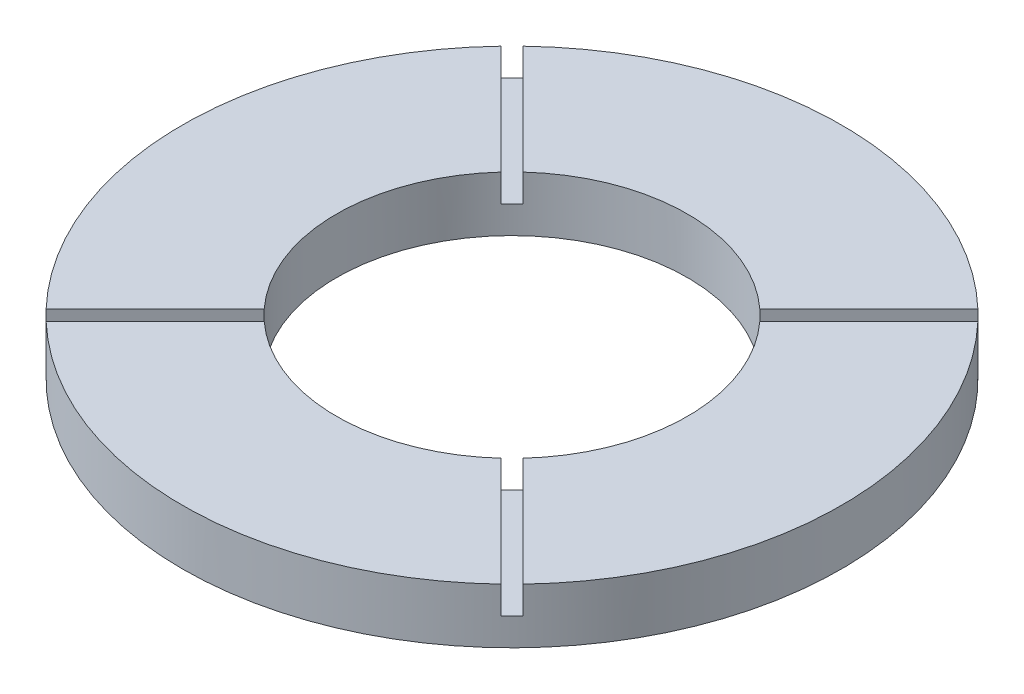
ISO-10303-21;
HEADER;
FILE_DESCRIPTION(('STEP AP214'),'2;1');
FILE_NAME('part.step','',(''),(''),'','','');
FILE_SCHEMA(('AUTOMOTIVE_DESIGN { 1 0 10303 214 1 1 1 1 }'));
ENDSEC;
DATA;
#1=APPLICATION_CONTEXT('core data for automotive mechanical design processes');
#2=APPLICATION_PROTOCOL_DEFINITION('international standard','automotive_design',2000,#1);
#3=PRODUCT_CONTEXT('',#1,'mechanical');
#4=PRODUCT('Part','Part','',(#3));
#5=PRODUCT_RELATED_PRODUCT_CATEGORY('part','',(#4));
#6=PRODUCT_DEFINITION_FORMATION('','',#4);
#7=PRODUCT_DEFINITION_CONTEXT('part definition',#1,'design');
#8=PRODUCT_DEFINITION('design','',#6,#7);
#9=PRODUCT_DEFINITION_SHAPE('','',#8);
#10=(LENGTH_UNIT() NAMED_UNIT(*) SI_UNIT(.MILLI.,.METRE.));
#11=(NAMED_UNIT(*) PLANE_ANGLE_UNIT() SI_UNIT($,.RADIAN.));
#12=(NAMED_UNIT(*) SI_UNIT($,.STERADIAN.) SOLID_ANGLE_UNIT());
#13=UNCERTAINTY_MEASURE_WITH_UNIT(LENGTH_MEASURE(1.E-05),#10,'distance_accuracy_value','');
#14=(GEOMETRIC_REPRESENTATION_CONTEXT(3) GLOBAL_UNCERTAINTY_ASSIGNED_CONTEXT((#13)) GLOBAL_UNIT_ASSIGNED_CONTEXT((#10,
#11,#12)) REPRESENTATION_CONTEXT('',''));
#15=CARTESIAN_POINT('',(0.,0.,0.));
#16=DIRECTION('',(0.,0.,1.));
#17=DIRECTION('',(1.,0.,0.));
#18=AXIS2_PLACEMENT_3D('',#15,#16,#17);
#19=CARTESIAN_POINT('',(0.,12.7000000000001,9.99200722162641E-13));
#20=DIRECTION('',(0.,1.,0.));
#21=DIRECTION('',(0.,0.,0.999999999999999));
#22=AXIS2_PLACEMENT_3D('',#19,#20,#21);
#23=PLANE('',#22);
#24=DIRECTION('',(0.707106781186543,0.,-0.707106781186551));
#25=VECTOR('',#24,1.);
#26=CARTESIAN_POINT('',(-25.7014930184937,12.7,28.1800437079164));
#27=LINE('',#26,#25);
#28=CARTESIAN_POINT('',(-52.4303897259785,12.7000000000001,54.9089404154025));
#29=VERTEX_POINT('',#28);
#30=CARTESIAN_POINT('',(-27.3090139490452,12.7000000000001,29.787564638468));
#31=VERTEX_POINT('',#30);
#32=EDGE_CURVE('E258',#29,#31,#27,.T.);
#33=ORIENTED_EDGE('',*,*,#32,.F.);
#34=CARTESIAN_POINT('',(0.,12.7000000000001,9.99200722162641E-13));
#35=DIRECTION('',(0.,1.,0.));
#36=DIRECTION('',(0.,0.,0.999999999999999));
#37=AXIS2_PLACEMENT_3D('',#34,#35,#36);
#38=CIRCLE('',#37,75.9206);
#39=CARTESIAN_POINT('',(52.4303897259886,12.7,54.908940415391));
#40=VERTEX_POINT('',#39);
#41=EDGE_CURVE('E199',#29,#40,#38,.T.);
#42=ORIENTED_EDGE('',*,*,#41,.T.);
#43=DIRECTION('',(0.707106781186551,0.,0.707106781186543));
#44=VECTOR('',#43,1.);
#45=CARTESIAN_POINT('',(25.7014930185064,12.7000000000001,28.1800437079101));
#46=LINE('',#45,#44);
#47=CARTESIAN_POINT('',(27.3090139490553,12.7000000000001,29.7875646384589));
#48=VERTEX_POINT('',#47);
#49=EDGE_CURVE('E328',#48,#40,#46,.T.);
#50=ORIENTED_EDGE('',*,*,#49,.F.);
#51=CARTESIAN_POINT('',(0.,12.7000000000001,9.99200722162641E-13));
#52=DIRECTION('',(0.,1.,0.));
#53=DIRECTION('',(0.,0.,0.999999999999999));
#54=AXIS2_PLACEMENT_3D('',#51,#52,#53);
#55=CIRCLE('',#54,40.4114);
#56=EDGE_CURVE('E266',#31,#48,#55,.T.);
#57=ORIENTED_EDGE('',*,*,#56,.F.);
#58=EDGE_LOOP('',(#33,#42,#50,#57));
#59=FACE_BOUND('',#58,.T.);
#60=ADVANCED_FACE('F53',(#59),#23,.T.);
#61=DIRECTION('',(-0.707106781186551,0.,-0.707106781186543));
#62=VECTOR('',#61,1.);
#63=CARTESIAN_POINT('',(28.1800437079215,12.7000000000001,25.7014930184949));
#64=LINE('',#63,#62);
#65=CARTESIAN_POINT('',(54.9089404154024,12.7,52.4303897259765));
#66=VERTEX_POINT('',#65);
#67=CARTESIAN_POINT('',(29.7875646384689,12.7000000000001,27.3090139490442));
#68=VERTEX_POINT('',#67);
#69=EDGE_CURVE('E332',#66,#68,#64,.T.);
#70=ORIENTED_EDGE('',*,*,#69,.F.);
#71=CARTESIAN_POINT('',(54.908940415394,12.7000000000001,-52.4303897259843));
#72=VERTEX_POINT('',#71);
#73=EDGE_CURVE('E205',#66,#72,#38,.T.);
#74=ORIENTED_EDGE('',*,*,#73,.T.);
#75=DIRECTION('',(0.707106781186543,0.,-0.707106781186551));
#76=VECTOR('',#75,1.);
#77=CARTESIAN_POINT('',(28.1800437079152,12.7000000000002,-25.7014930185051));
#78=LINE('',#77,#76);
#79=CARTESIAN_POINT('',(29.7875646384609,12.7000000000001,-27.3090139490509));
#80=VERTEX_POINT('',#79);
#81=EDGE_CURVE('E341',#80,#72,#78,.T.);
#82=ORIENTED_EDGE('',*,*,#81,.F.);
#83=EDGE_CURVE('E215',#68,#80,#55,.T.);
#84=ORIENTED_EDGE('',*,*,#83,.F.);
#85=EDGE_LOOP('',(#70,#74,#82,#84));
#86=FACE_BOUND('',#85,.T.);
#87=ADVANCED_FACE('F360',(#86),#23,.T.);
#88=DIRECTION('',(-0.707106781186543,0.,0.707106781186551));
#89=VECTOR('',#88,1.);
#90=CARTESIAN_POINT('',(25.7014930185,12.7000000000002,-28.1800437079203));
#91=LINE('',#90,#89);
#92=CARTESIAN_POINT('',(52.4303897259788,12.7000000000001,-54.9089404153993));
#93=VERTEX_POINT('',#92);
#94=CARTESIAN_POINT('',(27.3090139490465,12.7000000000001,-29.7875646384658));
#95=VERTEX_POINT('',#94);
#96=EDGE_CURVE('E190',#93,#95,#91,.T.);
#97=ORIENTED_EDGE('',*,*,#96,.F.);
#98=CARTESIAN_POINT('',(-52.4303897259822,12.7000000000002,-54.9089404153948));
#99=VERTEX_POINT('',#98);
#100=EDGE_CURVE('E198',#93,#99,#38,.T.);
#101=ORIENTED_EDGE('',*,*,#100,.T.);
#102=DIRECTION('',(-0.707106781186551,0.,-0.707106781186543));
#103=VECTOR('',#102,1.);
#104=CARTESIAN_POINT('',(-25.7014930185001,12.7000000000001,-28.1800437079138));
#105=LINE('',#104,#103);
#106=CARTESIAN_POINT('',(-27.3090139490488,12.7000000000001,-29.7875646384627));
#107=VERTEX_POINT('',#106);
#108=EDGE_CURVE('E189',#107,#99,#105,.T.);
#109=ORIENTED_EDGE('',*,*,#108,.F.);
#110=EDGE_CURVE('E265',#95,#107,#55,.T.);
#111=ORIENTED_EDGE('',*,*,#110,.F.);
#112=EDGE_LOOP('',(#97,#101,#109,#111));
#113=FACE_BOUND('',#112,.T.);
#114=ADVANCED_FACE('F402',(#113),#23,.T.);
#115=CARTESIAN_POINT('',(0.,12.7000000000001,9.99200722162641E-13));
#116=DIRECTION('',(0.,-1.,0.));
#117=DIRECTION('',(0.,0.,-0.999999999999999));
#118=AXIS2_PLACEMENT_3D('',#115,#116,#117);
#119=CYLINDRICAL_SURFACE('',#118,75.9206);
#120=ORIENTED_EDGE('',*,*,#41,.F.);
#121=DIRECTION('',(0.,-1.,0.));
#122=VECTOR('',#121,1.);
#123=CARTESIAN_POINT('',(-52.4303897259785,12.7000000000001,54.9089404154025));
#124=LINE('',#123,#122);
#125=CARTESIAN_POINT('',(-52.4303897259785,6.35000000000012,54.9089404154025));
#126=VERTEX_POINT('',#125);
#127=EDGE_CURVE('E273',#29,#126,#124,.T.);
#128=ORIENTED_EDGE('',*,*,#127,.T.);
#129=CARTESIAN_POINT('',(0.,6.35000000000012,9.99200722162641E-13));
#130=DIRECTION('',(0.,-1.,0.));
#131=DIRECTION('',(0.,0.,-0.999999999999999));
#132=AXIS2_PLACEMENT_3D('',#129,#130,#131);
#133=CIRCLE('',#132,75.9206);
#134=CARTESIAN_POINT('',(-54.9089404153937,6.35000000000012,52.4303897259876));
#135=VERTEX_POINT('',#134);
#136=EDGE_CURVE('E279',#126,#135,#133,.T.);
#137=ORIENTED_EDGE('',*,*,#136,.T.);
#138=DIRECTION('',(0.,-1.,0.));
#139=VECTOR('',#138,1.);
#140=CARTESIAN_POINT('',(-54.9089404153937,12.7000000000001,52.4303897259876));
#141=LINE('',#140,#139);
#142=CARTESIAN_POINT('',(-54.9089404153937,12.7000000000001,52.4303897259876));
#143=VERTEX_POINT('',#142);
#144=EDGE_CURVE('E196',#135,#143,#141,.F.);
#145=ORIENTED_EDGE('',*,*,#144,.T.);
#146=CARTESIAN_POINT('',(-54.9089404153974,12.7000000000003,-52.4303897259808));
#147=VERTEX_POINT('',#146);
#148=EDGE_CURVE('E185',#147,#143,#38,.T.);
#149=ORIENTED_EDGE('',*,*,#148,.F.);
#150=DIRECTION('',(0.,-1.,0.));
#151=VECTOR('',#150,1.);
#152=CARTESIAN_POINT('',(-54.9089404153974,12.7000000000003,-52.4303897259808));
#153=LINE('',#152,#151);
#154=CARTESIAN_POINT('',(-54.9089404153974,6.35000000000024,-52.4303897259808));
#155=VERTEX_POINT('',#154);
#156=EDGE_CURVE('E166',#147,#155,#153,.T.);
#157=ORIENTED_EDGE('',*,*,#156,.T.);
#158=CARTESIAN_POINT('',(0.,6.35000000000012,9.99200722162641E-13));
#159=DIRECTION('',(0.,-1.,0.));
#160=DIRECTION('',(0.,0.,-0.999999999999999));
#161=AXIS2_PLACEMENT_3D('',#158,#159,#160);
#162=CIRCLE('',#161,75.9206);
#163=CARTESIAN_POINT('',(-52.4303897259824,6.35000000000024,-54.9089404153948));
#164=VERTEX_POINT('',#163);
#165=EDGE_CURVE('E308',#155,#164,#162,.T.);
#166=ORIENTED_EDGE('',*,*,#165,.T.);
#167=DIRECTION('',(0.,-1.,0.));
#168=VECTOR('',#167,1.);
#169=CARTESIAN_POINT('',(-52.4303897259822,12.7000000000002,-54.9089404153948));
#170=LINE('',#169,#168);
#171=EDGE_CURVE('E178',#164,#99,#170,.F.);
#172=ORIENTED_EDGE('',*,*,#171,.T.);
#173=ORIENTED_EDGE('',*,*,#100,.F.);
#174=DIRECTION('',(0.,-1.,0.));
#175=VECTOR('',#174,1.);
#176=CARTESIAN_POINT('',(52.4303897259788,12.7000000000001,-54.9089404153993));
#177=LINE('',#176,#175);
#178=CARTESIAN_POINT('',(52.4303897259788,6.35000000000012,-54.9089404153993));
#179=VERTEX_POINT('',#178);
#180=EDGE_CURVE('E294',#93,#179,#177,.T.);
#181=ORIENTED_EDGE('',*,*,#180,.T.);
#182=CARTESIAN_POINT('',(0.,6.35000000000012,9.99200722162641E-13));
#183=DIRECTION('',(0.,-1.,0.));
#184=DIRECTION('',(0.,0.,-0.999999999999999));
#185=AXIS2_PLACEMENT_3D('',#182,#183,#184);
#186=CIRCLE('',#185,75.9206);
#187=CARTESIAN_POINT('',(54.9089404153931,6.35000000000012,-52.4303897259843));
#188=VERTEX_POINT('',#187);
#189=EDGE_CURVE('E177',#179,#188,#186,.T.);
#190=ORIENTED_EDGE('',*,*,#189,.T.);
#191=DIRECTION('',(0.,-1.,0.));
#192=VECTOR('',#191,1.);
#193=CARTESIAN_POINT('',(54.908940415394,12.7000000000001,-52.4303897259843));
#194=LINE('',#193,#192);
#195=EDGE_CURVE('E298',#188,#72,#194,.F.);
#196=ORIENTED_EDGE('',*,*,#195,.T.);
#197=ORIENTED_EDGE('',*,*,#73,.F.);
#198=DIRECTION('',(0.,-1.,0.));
#199=VECTOR('',#198,1.);
#200=CARTESIAN_POINT('',(54.9089404154024,12.7,52.4303897259765));
#201=LINE('',#200,#199);
#202=CARTESIAN_POINT('',(54.9089404154024,6.35000000000001,52.4303897259765));
#203=VERTEX_POINT('',#202);
#204=EDGE_CURVE('E282',#66,#203,#201,.T.);
#205=ORIENTED_EDGE('',*,*,#204,.T.);
#206=CARTESIAN_POINT('',(0.,6.35000000000012,9.99200722162641E-13));
#207=DIRECTION('',(0.,-1.,0.));
#208=DIRECTION('',(0.,0.,-0.999999999999999));
#209=AXIS2_PLACEMENT_3D('',#206,#207,#208);
#210=CIRCLE('',#209,75.9206);
#211=CARTESIAN_POINT('',(52.4303897259886,6.35000000000001,54.908940415391));
#212=VERTEX_POINT('',#211);
#213=EDGE_CURVE('E290',#203,#212,#210,.T.);
#214=ORIENTED_EDGE('',*,*,#213,.T.);
#215=DIRECTION('',(0.,-1.,0.));
#216=VECTOR('',#215,1.);
#217=CARTESIAN_POINT('',(52.4303897259886,12.7,54.908940415391));
#218=LINE('',#217,#216);
#219=EDGE_CURVE('E286',#212,#40,#218,.F.);
#220=ORIENTED_EDGE('',*,*,#219,.T.);
#221=EDGE_LOOP('',(#120,#128,#137,#145,#149,#157,#166,#172,#173,#181,#190,#196,#197,#205,#214,#220));
#222=FACE_BOUND('',#221,.T.);
#223=CARTESIAN_POINT('',(0.,0.,0.));
#224=DIRECTION('',(0.,1.,0.));
#225=DIRECTION('',(0.,0.,0.999999999999999));
#226=AXIS2_PLACEMENT_3D('',#223,#224,#225);
#227=CIRCLE('',#226,75.9206);
#228=CARTESIAN_POINT('',(0.,0.,75.9205999999999));
#229=VERTEX_POINT('',#228);
#230=EDGE_CURVE('E207',#229,#229,#227,.T.);
#231=ORIENTED_EDGE('',*,*,#230,.T.);
#232=EDGE_LOOP('',(#231));
#233=FACE_BOUND('',#232,.T.);
#234=ADVANCED_FACE('F55',(#222,#233),#119,.T.);
#235=DIRECTION('',(-0.707106781186543,0.,0.707106781186551));
#236=VECTOR('',#235,1.);
#237=CARTESIAN_POINT('',(-28.1800437079087,12.7,25.7014930185012));
#238=LINE('',#237,#236);
#239=CARTESIAN_POINT('',(-29.7875646384617,12.7000000000001,27.3090139490532));
#240=VERTEX_POINT('',#239);
#241=EDGE_CURVE('E252',#240,#143,#238,.T.);
#242=ORIENTED_EDGE('',*,*,#241,.F.);
#243=CARTESIAN_POINT('',(-29.787564638464,12.7000000000001,-27.3090139490475));
#244=VERTEX_POINT('',#243);
#245=EDGE_CURVE('E187',#244,#240,#55,.T.);
#246=ORIENTED_EDGE('',*,*,#245,.F.);
#247=DIRECTION('',(0.707106781186551,0.,0.707106781186544));
#248=VECTOR('',#247,1.);
#249=CARTESIAN_POINT('',(-28.1800437079152,12.7000000000001,-25.7014930184988));
#250=LINE('',#249,#248);
#251=EDGE_CURVE('E170',#147,#244,#250,.T.);
#252=ORIENTED_EDGE('',*,*,#251,.F.);
#253=ORIENTED_EDGE('',*,*,#148,.T.);
#254=EDGE_LOOP('',(#242,#246,#252,#253));
#255=FACE_BOUND('',#254,.T.);
#256=ADVANCED_FACE('F184',(#255),#23,.T.);
#257=CARTESIAN_POINT('',(0.,0.,0.));
#258=DIRECTION('',(0.,1.,0.));
#259=DIRECTION('',(0.,0.,0.999999999999999));
#260=AXIS2_PLACEMENT_3D('',#257,#258,#259);
#261=PLANE('',#260);
#262=CARTESIAN_POINT('',(0.,0.,0.));
#263=DIRECTION('',(0.,1.,0.));
#264=DIRECTION('',(0.,0.,0.999999999999999));
#265=AXIS2_PLACEMENT_3D('',#262,#263,#264);
#266=CIRCLE('',#265,40.4114);
#267=CARTESIAN_POINT('',(0.,0.,40.4114));
#268=VERTEX_POINT('',#267);
#269=EDGE_CURVE('E210',#268,#268,#266,.T.);
#270=ORIENTED_EDGE('',*,*,#269,.T.);
#271=EDGE_LOOP('',(#270));
#272=FACE_BOUND('',#271,.T.);
#273=ORIENTED_EDGE('',*,*,#230,.F.);
#274=EDGE_LOOP('',(#273));
#275=FACE_BOUND('',#274,.T.);
#276=ADVANCED_FACE('F405',(#272,#275),#261,.F.);
#277=CARTESIAN_POINT('',(0.,12.7000000000001,9.99200722162641E-13));
#278=DIRECTION('',(0.,-1.,0.));
#279=DIRECTION('',(0.,0.,-0.999999999999999));
#280=AXIS2_PLACEMENT_3D('',#277,#278,#279);
#281=CYLINDRICAL_SURFACE('',#280,40.4114);
#282=DIRECTION('',(0.,-1.,0.));
#283=VECTOR('',#282,1.);
#284=CARTESIAN_POINT('',(-27.3090139490453,12.7000000000001,29.787564638468));
#285=LINE('',#284,#283);
#286=CARTESIAN_POINT('',(-27.3090139490452,6.35000000000012,29.787564638468));
#287=VERTEX_POINT('',#286);
#288=EDGE_CURVE('E13',#31,#287,#285,.T.);
#289=ORIENTED_EDGE('',*,*,#288,.F.);
#290=ORIENTED_EDGE('',*,*,#56,.T.);
#291=DIRECTION('',(0.,-1.,0.));
#292=VECTOR('',#291,1.);
#293=CARTESIAN_POINT('',(27.3090139490553,12.7000000000001,29.7875646384589));
#294=LINE('',#293,#292);
#295=CARTESIAN_POINT('',(27.3090139490553,6.35000000000013,29.7875646384589));
#296=VERTEX_POINT('',#295);
#297=EDGE_CURVE('E238',#296,#48,#294,.F.);
#298=ORIENTED_EDGE('',*,*,#297,.F.);
#299=CARTESIAN_POINT('',(0.,6.35000000000012,9.99200722162641E-13));
#300=DIRECTION('',(0.,-1.,0.));
#301=DIRECTION('',(0.,0.,-0.999999999999999));
#302=AXIS2_PLACEMENT_3D('',#299,#300,#301);
#303=CIRCLE('',#302,40.4114);
#304=CARTESIAN_POINT('',(29.7875646384689,6.35000000000012,27.3090139490442));
#305=VERTEX_POINT('',#304);
#306=EDGE_CURVE('E235',#305,#296,#303,.T.);
#307=ORIENTED_EDGE('',*,*,#306,.F.);
#308=DIRECTION('',(0.,-1.,0.));
#309=VECTOR('',#308,1.);
#310=CARTESIAN_POINT('',(29.7875646384689,12.7000000000001,27.3090139490442));
#311=LINE('',#310,#309);
#312=EDGE_CURVE('E241',#68,#305,#311,.T.);
#313=ORIENTED_EDGE('',*,*,#312,.F.);
#314=ORIENTED_EDGE('',*,*,#83,.T.);
#315=DIRECTION('',(0.,-1.,0.));
#316=VECTOR('',#315,1.);
#317=CARTESIAN_POINT('',(29.7875646384609,12.7000000000001,-27.3090139490509));
#318=LINE('',#317,#316);
#319=CARTESIAN_POINT('',(29.7875646384609,6.35000000000013,-27.3090139490509));
#320=VERTEX_POINT('',#319);
#321=EDGE_CURVE('E228',#320,#80,#318,.F.);
#322=ORIENTED_EDGE('',*,*,#321,.F.);
#323=CARTESIAN_POINT('',(0.,6.35000000000012,9.99200722162641E-13));
#324=DIRECTION('',(0.,-1.,0.));
#325=DIRECTION('',(0.,0.,-0.999999999999999));
#326=AXIS2_PLACEMENT_3D('',#323,#324,#325);
#327=CIRCLE('',#326,40.4114);
#328=CARTESIAN_POINT('',(27.3090139490465,6.35000000000013,-29.7875646384658));
#329=VERTEX_POINT('',#328);
#330=EDGE_CURVE('E225',#329,#320,#327,.T.);
#331=ORIENTED_EDGE('',*,*,#330,.F.);
#332=DIRECTION('',(0.,-1.,0.));
#333=VECTOR('',#332,1.);
#334=CARTESIAN_POINT('',(27.3090139490465,12.7000000000001,-29.7875646384658));
#335=LINE('',#334,#333);
#336=EDGE_CURVE('E231',#95,#329,#335,.T.);
#337=ORIENTED_EDGE('',*,*,#336,.F.);
#338=ORIENTED_EDGE('',*,*,#110,.T.);
#339=DIRECTION('',(0.,-1.,0.));
#340=VECTOR('',#339,1.);
#341=CARTESIAN_POINT('',(-27.3090139490488,12.7000000000001,-29.7875646384627));
#342=LINE('',#341,#340);
#343=CARTESIAN_POINT('',(-27.3090139490489,6.35000000000012,-29.7875646384627));
#344=VERTEX_POINT('',#343);
#345=EDGE_CURVE('E219',#344,#107,#342,.F.);
#346=ORIENTED_EDGE('',*,*,#345,.F.);
#347=CARTESIAN_POINT('',(0.,6.35000000000012,9.99200722162641E-13));
#348=DIRECTION('',(0.,-1.,0.));
#349=DIRECTION('',(0.,0.,-0.999999999999999));
#350=AXIS2_PLACEMENT_3D('',#347,#348,#349);
#351=CIRCLE('',#350,40.4114);
#352=CARTESIAN_POINT('',(-29.787564638464,6.35000000000012,-27.3090139490475));
#353=VERTEX_POINT('',#352);
#354=EDGE_CURVE('E216',#353,#344,#351,.T.);
#355=ORIENTED_EDGE('',*,*,#354,.F.);
#356=DIRECTION('',(0.,-1.,0.));
#357=VECTOR('',#356,1.);
#358=CARTESIAN_POINT('',(-29.787564638464,12.7000000000001,-27.3090139490475));
#359=LINE('',#358,#357);
#360=EDGE_CURVE('E222',#244,#353,#359,.T.);
#361=ORIENTED_EDGE('',*,*,#360,.F.);
#362=ORIENTED_EDGE('',*,*,#245,.T.);
#363=DIRECTION('',(0.,-1.,0.));
#364=VECTOR('',#363,1.);
#365=CARTESIAN_POINT('',(-29.7875646384617,12.7000000000001,27.3090139490532));
#366=LINE('',#365,#364);
#367=CARTESIAN_POINT('',(-29.7875646384617,6.35000000000012,27.3090139490532));
#368=VERTEX_POINT('',#367);
#369=EDGE_CURVE('E62',#368,#240,#366,.F.);
#370=ORIENTED_EDGE('',*,*,#369,.F.);
#371=CARTESIAN_POINT('',(0.,6.35000000000012,9.99200722162641E-13));
#372=DIRECTION('',(0.,-1.,0.));
#373=DIRECTION('',(0.,0.,-0.999999999999999));
#374=AXIS2_PLACEMENT_3D('',#371,#372,#373);
#375=CIRCLE('',#374,40.4114);
#376=EDGE_CURVE('E244',#287,#368,#375,.T.);
#377=ORIENTED_EDGE('',*,*,#376,.F.);
#378=EDGE_LOOP('',(#289,#290,#298,#307,#313,#314,#322,#331,#337,#338,#346,#355,#361,#362,#370,#377));
#379=FACE_BOUND('',#378,.T.);
#380=ORIENTED_EDGE('',*,*,#269,.F.);
#381=EDGE_LOOP('',(#380));
#382=FACE_BOUND('',#381,.T.);
#383=ADVANCED_FACE('F261',(#379,#382),#281,.F.);
#384=CARTESIAN_POINT('',(-28.1800437079152,6.35000000000012,-25.7014930184988));
#385=DIRECTION('',(-0.707106781186544,0.,0.70710678118655));
#386=DIRECTION('',(0.70710678118655,0.,0.707106781186544));
#387=AXIS2_PLACEMENT_3D('',#384,#385,#386);
#388=PLANE('',#387);
#389=ORIENTED_EDGE('',*,*,#251,.T.);
#390=ORIENTED_EDGE('',*,*,#360,.T.);
#391=DIRECTION('',(0.707106781186551,0.,0.707106781186544));
#392=VECTOR('',#391,1.);
#393=CARTESIAN_POINT('',(-28.1800437079152,6.35000000000012,-25.7014930184988));
#394=LINE('',#393,#392);
#395=EDGE_CURVE('E172',#155,#353,#394,.T.);
#396=ORIENTED_EDGE('',*,*,#395,.F.);
#397=ORIENTED_EDGE('',*,*,#156,.F.);
#398=EDGE_LOOP('',(#389,#390,#396,#397));
#399=FACE_BOUND('',#398,.T.);
#400=ADVANCED_FACE('F168',(#399),#388,.F.);
#401=CARTESIAN_POINT('',(-25.7014930185001,6.35000000000012,-28.1800437079138));
#402=DIRECTION('',(0.707106781186543,0.,-0.70710678118655));
#403=DIRECTION('',(-0.707106781186551,0.,-0.707106781186544));
#404=AXIS2_PLACEMENT_3D('',#401,#402,#403);
#405=PLANE('',#404);
#406=DIRECTION('',(-0.707106781186551,0.,-0.707106781186543));
#407=VECTOR('',#406,1.);
#408=CARTESIAN_POINT('',(-25.7014930185001,6.35000000000012,-28.1800437079138));
#409=LINE('',#408,#407);
#410=EDGE_CURVE('E311',#344,#164,#409,.T.);
#411=ORIENTED_EDGE('',*,*,#410,.F.);
#412=ORIENTED_EDGE('',*,*,#345,.T.);
#413=ORIENTED_EDGE('',*,*,#108,.T.);
#414=ORIENTED_EDGE('',*,*,#171,.F.);
#415=EDGE_LOOP('',(#411,#412,#413,#414));
#416=FACE_BOUND('',#415,.T.);
#417=ADVANCED_FACE('F423',(#416),#405,.F.);
#418=CARTESIAN_POINT('',(0.,6.35000000000012,9.99200722162641E-13));
#419=DIRECTION('',(0.,-1.,0.));
#420=DIRECTION('',(0.,0.,-0.999999999999999));
#421=AXIS2_PLACEMENT_3D('',#418,#419,#420);
#422=PLANE('',#421);
#423=ORIENTED_EDGE('',*,*,#395,.T.);
#424=ORIENTED_EDGE('',*,*,#354,.T.);
#425=ORIENTED_EDGE('',*,*,#410,.T.);
#426=ORIENTED_EDGE('',*,*,#165,.F.);
#427=EDGE_LOOP('',(#423,#424,#425,#426));
#428=FACE_BOUND('',#427,.T.);
#429=ADVANCED_FACE('F426',(#428),#422,.F.);
#430=CARTESIAN_POINT('',(25.7014930185,6.35000000000024,-28.1800437079203));
#431=DIRECTION('',(-0.70710678118655,0.,-0.707106781186543));
#432=DIRECTION('',(-0.707106781186544,0.,0.707106781186551));
#433=AXIS2_PLACEMENT_3D('',#430,#431,#432);
#434=PLANE('',#433);
#435=ORIENTED_EDGE('',*,*,#96,.T.);
#436=ORIENTED_EDGE('',*,*,#336,.T.);
#437=DIRECTION('',(-0.707106781186543,0.,0.707106781186551));
#438=VECTOR('',#437,1.);
#439=CARTESIAN_POINT('',(25.7014930185,6.35000000000024,-28.1800437079203));
#440=LINE('',#439,#438);
#441=EDGE_CURVE('E338',#179,#329,#440,.T.);
#442=ORIENTED_EDGE('',*,*,#441,.F.);
#443=ORIENTED_EDGE('',*,*,#180,.F.);
#444=EDGE_LOOP('',(#435,#436,#442,#443));
#445=FACE_BOUND('',#444,.T.);
#446=ADVANCED_FACE('F429',(#445),#434,.F.);
#447=CARTESIAN_POINT('',(28.1800437079152,6.35000000000013,-25.7014930185051));
#448=DIRECTION('',(0.70710678118655,0.,0.707106781186543));
#449=DIRECTION('',(0.707106781186544,0.,-0.707106781186551));
#450=AXIS2_PLACEMENT_3D('',#447,#448,#449);
#451=PLANE('',#450);
#452=DIRECTION('',(0.707106781186543,0.,-0.707106781186551));
#453=VECTOR('',#452,1.);
#454=CARTESIAN_POINT('',(28.1800437079152,6.35000000000013,-25.7014930185051));
#455=LINE('',#454,#453);
#456=EDGE_CURVE('E335',#320,#188,#455,.T.);
#457=ORIENTED_EDGE('',*,*,#456,.F.);
#458=ORIENTED_EDGE('',*,*,#321,.T.);
#459=ORIENTED_EDGE('',*,*,#81,.T.);
#460=ORIENTED_EDGE('',*,*,#195,.F.);
#461=EDGE_LOOP('',(#457,#458,#459,#460));
#462=FACE_BOUND('',#461,.T.);
#463=ADVANCED_FACE('F352',(#462),#451,.F.);
#464=CARTESIAN_POINT('',(0.,6.35000000000012,9.99200722162641E-13));
#465=DIRECTION('',(0.,-1.,0.));
#466=DIRECTION('',(0.,0.,-0.999999999999999));
#467=AXIS2_PLACEMENT_3D('',#464,#465,#466);
#468=PLANE('',#467);
#469=ORIENTED_EDGE('',*,*,#441,.T.);
#470=ORIENTED_EDGE('',*,*,#330,.T.);
#471=ORIENTED_EDGE('',*,*,#456,.T.);
#472=ORIENTED_EDGE('',*,*,#189,.F.);
#473=EDGE_LOOP('',(#469,#470,#471,#472));
#474=FACE_BOUND('',#473,.T.);
#475=ADVANCED_FACE('F431',(#474),#468,.F.);
#476=CARTESIAN_POINT('',(28.1800437079215,6.35000000000012,25.7014930184949));
#477=DIRECTION('',(0.707106781186543,0.,-0.707106781186551));
#478=DIRECTION('',(-0.707106781186551,0.,-0.707106781186543));
#479=AXIS2_PLACEMENT_3D('',#476,#477,#478);
#480=PLANE('',#479);
#481=ORIENTED_EDGE('',*,*,#69,.T.);
#482=ORIENTED_EDGE('',*,*,#312,.T.);
#483=DIRECTION('',(-0.707106781186551,0.,-0.707106781186543));
#484=VECTOR('',#483,1.);
#485=CARTESIAN_POINT('',(28.1800437079215,6.35000000000012,25.7014930184949));
#486=LINE('',#485,#484);
#487=EDGE_CURVE('E76',#203,#305,#486,.T.);
#488=ORIENTED_EDGE('',*,*,#487,.F.);
#489=ORIENTED_EDGE('',*,*,#204,.F.);
#490=EDGE_LOOP('',(#481,#482,#488,#489));
#491=FACE_BOUND('',#490,.T.);
#492=ADVANCED_FACE('F376',(#491),#480,.F.);
#493=CARTESIAN_POINT('',(25.7014930185064,6.35000000000013,28.1800437079101));
#494=DIRECTION('',(-0.707106781186543,0.,0.707106781186551));
#495=DIRECTION('',(0.707106781186551,0.,0.707106781186543));
#496=AXIS2_PLACEMENT_3D('',#493,#494,#495);
#497=PLANE('',#496);
#498=DIRECTION('',(0.707106781186551,0.,0.707106781186543));
#499=VECTOR('',#498,1.);
#500=CARTESIAN_POINT('',(25.7014930185064,6.35000000000013,28.1800437079101));
#501=LINE('',#500,#499);
#502=EDGE_CURVE('E324',#296,#212,#501,.T.);
#503=ORIENTED_EDGE('',*,*,#502,.F.);
#504=ORIENTED_EDGE('',*,*,#297,.T.);
#505=ORIENTED_EDGE('',*,*,#49,.T.);
#506=ORIENTED_EDGE('',*,*,#219,.F.);
#507=EDGE_LOOP('',(#503,#504,#505,#506));
#508=FACE_BOUND('',#507,.T.);
#509=ADVANCED_FACE('F382',(#508),#497,.F.);
#510=CARTESIAN_POINT('',(0.,6.35000000000012,9.99200722162641E-13));
#511=DIRECTION('',(0.,-1.,0.));
#512=DIRECTION('',(0.,0.,-0.999999999999999));
#513=AXIS2_PLACEMENT_3D('',#510,#511,#512);
#514=PLANE('',#513);
#515=ORIENTED_EDGE('',*,*,#487,.T.);
#516=ORIENTED_EDGE('',*,*,#306,.T.);
#517=ORIENTED_EDGE('',*,*,#502,.T.);
#518=ORIENTED_EDGE('',*,*,#213,.F.);
#519=EDGE_LOOP('',(#515,#516,#517,#518));
#520=FACE_BOUND('',#519,.T.);
#521=ADVANCED_FACE('F380',(#520),#514,.F.);
#522=CARTESIAN_POINT('',(-25.7014930184937,6.35000000000002,28.1800437079164));
#523=DIRECTION('',(0.707106781186551,0.,0.707106781186543));
#524=DIRECTION('',(0.707106781186543,0.,-0.707106781186551));
#525=AXIS2_PLACEMENT_3D('',#522,#523,#524);
#526=PLANE('',#525);
#527=ORIENTED_EDGE('',*,*,#32,.T.);
#528=ORIENTED_EDGE('',*,*,#288,.T.);
#529=DIRECTION('',(0.707106781186543,0.,-0.707106781186551));
#530=VECTOR('',#529,1.);
#531=CARTESIAN_POINT('',(-25.7014930184937,6.35000000000002,28.1800437079164));
#532=LINE('',#531,#530);
#533=EDGE_CURVE('E69',#126,#287,#532,.T.);
#534=ORIENTED_EDGE('',*,*,#533,.F.);
#535=ORIENTED_EDGE('',*,*,#127,.F.);
#536=EDGE_LOOP('',(#527,#528,#534,#535));
#537=FACE_BOUND('',#536,.T.);
#538=ADVANCED_FACE('F388',(#537),#526,.F.);
#539=CARTESIAN_POINT('',(-28.1800437079087,6.35000000000012,25.7014930185013));
#540=DIRECTION('',(-0.707106781186551,0.,-0.707106781186543));
#541=DIRECTION('',(-0.707106781186543,0.,0.707106781186551));
#542=AXIS2_PLACEMENT_3D('',#539,#540,#541);
#543=PLANE('',#542);
#544=DIRECTION('',(-0.707106781186543,0.,0.707106781186551));
#545=VECTOR('',#544,1.);
#546=CARTESIAN_POINT('',(-28.1800437079087,6.35000000000012,25.7014930185013));
#547=LINE('',#546,#545);
#548=EDGE_CURVE('E254',#368,#135,#547,.T.);
#549=ORIENTED_EDGE('',*,*,#548,.F.);
#550=ORIENTED_EDGE('',*,*,#369,.T.);
#551=ORIENTED_EDGE('',*,*,#241,.T.);
#552=ORIENTED_EDGE('',*,*,#144,.F.);
#553=EDGE_LOOP('',(#549,#550,#551,#552));
#554=FACE_BOUND('',#553,.T.);
#555=ADVANCED_FACE('F251',(#554),#543,.F.);
#556=CARTESIAN_POINT('',(0.,6.35000000000012,9.99200722162641E-13));
#557=DIRECTION('',(0.,-1.,0.));
#558=DIRECTION('',(0.,0.,-0.999999999999999));
#559=AXIS2_PLACEMENT_3D('',#556,#557,#558);
#560=PLANE('',#559);
#561=ORIENTED_EDGE('',*,*,#533,.T.);
#562=ORIENTED_EDGE('',*,*,#376,.T.);
#563=ORIENTED_EDGE('',*,*,#548,.T.);
#564=ORIENTED_EDGE('',*,*,#136,.F.);
#565=EDGE_LOOP('',(#561,#562,#563,#564));
#566=FACE_BOUND('',#565,.T.);
#567=ADVANCED_FACE('F389',(#566),#560,.F.);
#568=CLOSED_SHELL('',(#60,#87,#114,#234,#256,#276,#383,#400,#417,#429,#446,#463,#475,#492,#509,
#521,#538,#555,#567));
#569=MANIFOLD_SOLID_BREP('B2',#568);
#570=ADVANCED_BREP_SHAPE_REPRESENTATION('',(#18,#569),#14);
#571=SHAPE_DEFINITION_REPRESENTATION(#9,#570);
ENDSEC;
END-ISO-10303-21;
